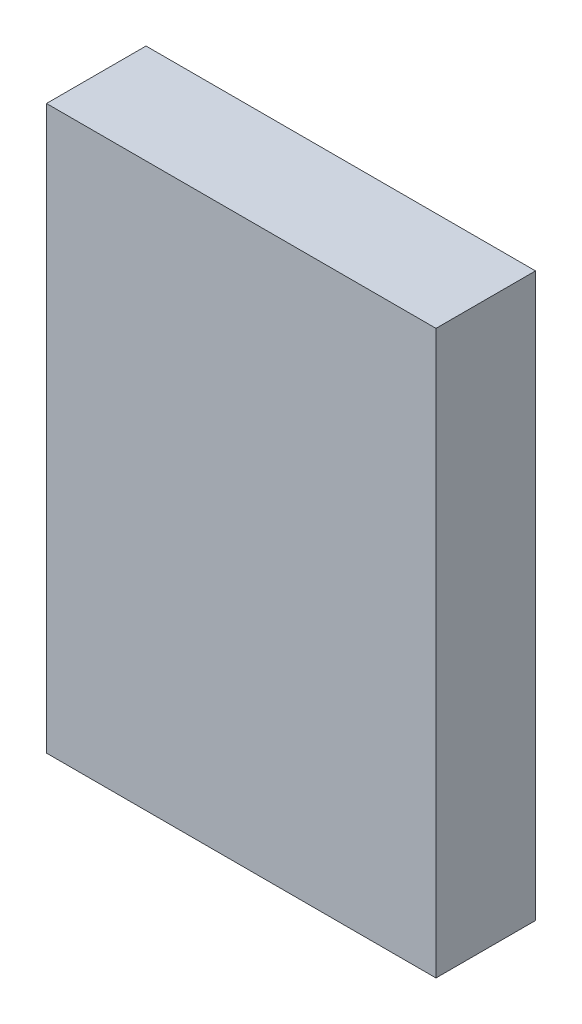
ISO-10303-21;
HEADER;
FILE_DESCRIPTION(('STEP AP214'),'2;1');
FILE_NAME('part.step','',(''),(''),'','','');
FILE_SCHEMA(('AUTOMOTIVE_DESIGN { 1 0 10303 214 1 1 1 1 }'));
ENDSEC;
DATA;
#1=APPLICATION_CONTEXT('core data for automotive mechanical design processes');
#2=APPLICATION_PROTOCOL_DEFINITION('international standard','automotive_design',2000,#1);
#3=PRODUCT_CONTEXT('',#1,'mechanical');
#4=PRODUCT('Part','Part','',(#3));
#5=PRODUCT_RELATED_PRODUCT_CATEGORY('part','',(#4));
#6=PRODUCT_DEFINITION_FORMATION('','',#4);
#7=PRODUCT_DEFINITION_CONTEXT('part definition',#1,'design');
#8=PRODUCT_DEFINITION('design','',#6,#7);
#9=PRODUCT_DEFINITION_SHAPE('','',#8);
#10=(LENGTH_UNIT() NAMED_UNIT(*) SI_UNIT(.MILLI.,.METRE.));
#11=(NAMED_UNIT(*) PLANE_ANGLE_UNIT() SI_UNIT($,.RADIAN.));
#12=(NAMED_UNIT(*) SI_UNIT($,.STERADIAN.) SOLID_ANGLE_UNIT());
#13=UNCERTAINTY_MEASURE_WITH_UNIT(LENGTH_MEASURE(1.E-05),#10,'distance_accuracy_value','');
#14=(GEOMETRIC_REPRESENTATION_CONTEXT(3) GLOBAL_UNCERTAINTY_ASSIGNED_CONTEXT((#13)) GLOBAL_UNIT_ASSIGNED_CONTEXT((#10,
#11,#12)) REPRESENTATION_CONTEXT('',''));
#15=CARTESIAN_POINT('',(0.,0.,0.));
#16=DIRECTION('',(0.,0.,1.));
#17=DIRECTION('',(1.,0.,0.));
#18=AXIS2_PLACEMENT_3D('',#15,#16,#17);
#19=CARTESIAN_POINT('',(-2.25000058,3.25000112,1.15000024));
#20=DIRECTION('',(0.,0.,1.));
#21=DIRECTION('',(1.,0.,0.));
#22=AXIS2_PLACEMENT_3D('',#19,#20,#21);
#23=PLANE('',#22);
#24=DIRECTION('',(0.,1.,0.));
#25=VECTOR('',#24,1.);
#26=CARTESIAN_POINT('',(2.25000058,3.25000112,1.15000024));
#27=LINE('',#26,#25);
#28=CARTESIAN_POINT('',(2.25000058,3.25000112,1.15000024));
#29=VERTEX_POINT('',#28);
#30=CARTESIAN_POINT('',(2.25000058,-3.25000112,1.15000024));
#31=VERTEX_POINT('',#30);
#32=EDGE_CURVE('E51',#29,#31,#27,.F.);
#33=ORIENTED_EDGE('',*,*,#32,.F.);
#34=DIRECTION('',(1.,0.,0.));
#35=VECTOR('',#34,1.);
#36=CARTESIAN_POINT('',(-2.25000058,3.25000112,1.15000024));
#37=LINE('',#36,#35);
#38=CARTESIAN_POINT('',(-2.25000058,3.25000112,1.15000024));
#39=VERTEX_POINT('',#38);
#40=EDGE_CURVE('E66',#39,#29,#37,.T.);
#41=ORIENTED_EDGE('',*,*,#40,.F.);
#42=DIRECTION('',(0.,1.,0.));
#43=VECTOR('',#42,1.);
#44=CARTESIAN_POINT('',(-2.25000058,-3.25000112,1.15000024));
#45=LINE('',#44,#43);
#46=CARTESIAN_POINT('',(-2.25000058,-3.25000112,1.15000024));
#47=VERTEX_POINT('',#46);
#48=EDGE_CURVE('E18',#47,#39,#45,.T.);
#49=ORIENTED_EDGE('',*,*,#48,.F.);
#50=DIRECTION('',(1.,0.,0.));
#51=VECTOR('',#50,1.);
#52=CARTESIAN_POINT('',(2.25000058,-3.25000112,1.15000024));
#53=LINE('',#52,#51);
#54=EDGE_CURVE('E56',#31,#47,#53,.F.);
#55=ORIENTED_EDGE('',*,*,#54,.F.);
#56=EDGE_LOOP('',(#33,#41,#49,#55));
#57=FACE_BOUND('',#56,.T.);
#58=ADVANCED_FACE('F15',(#57),#23,.T.);
#59=CARTESIAN_POINT('',(-2.25000058,-3.25000112,0.));
#60=DIRECTION('',(-1.,0.,0.));
#61=DIRECTION('',(0.,0.,1.));
#62=AXIS2_PLACEMENT_3D('',#59,#60,#61);
#63=PLANE('',#62);
#64=DIRECTION('',(0.,0.,1.));
#65=VECTOR('',#64,1.);
#66=CARTESIAN_POINT('',(-2.25000058,3.25000112,0.));
#67=LINE('',#66,#65);
#68=CARTESIAN_POINT('',(-2.25000058,3.25000112,0.));
#69=VERTEX_POINT('',#68);
#70=EDGE_CURVE('E77',#69,#39,#67,.T.);
#71=ORIENTED_EDGE('',*,*,#70,.F.);
#72=DIRECTION('',(0.,1.,0.));
#73=VECTOR('',#72,1.);
#74=CARTESIAN_POINT('',(-2.25000058,3.25000112,0.));
#75=LINE('',#74,#73);
#76=CARTESIAN_POINT('',(-2.25000058,-3.25000112,0.));
#77=VERTEX_POINT('',#76);
#78=EDGE_CURVE('E72',#69,#77,#75,.F.);
#79=ORIENTED_EDGE('',*,*,#78,.T.);
#80=DIRECTION('',(0.,0.,-1.));
#81=VECTOR('',#80,1.);
#82=CARTESIAN_POINT('',(-2.25000058,-3.25000112,0.));
#83=LINE('',#82,#81);
#84=EDGE_CURVE('E61',#47,#77,#83,.T.);
#85=ORIENTED_EDGE('',*,*,#84,.F.);
#86=ORIENTED_EDGE('',*,*,#48,.T.);
#87=EDGE_LOOP('',(#71,#79,#85,#86));
#88=FACE_BOUND('',#87,.T.);
#89=ADVANCED_FACE('F71',(#88),#63,.T.);
#90=CARTESIAN_POINT('',(2.25000058,-3.25000112,0.));
#91=DIRECTION('',(0.,-1.,0.));
#92=DIRECTION('',(0.,0.,-1.));
#93=AXIS2_PLACEMENT_3D('',#90,#91,#92);
#94=PLANE('',#93);
#95=ORIENTED_EDGE('',*,*,#84,.T.);
#96=DIRECTION('',(1.,0.,0.));
#97=VECTOR('',#96,1.);
#98=CARTESIAN_POINT('',(-2.25000058,-3.25000112,0.));
#99=LINE('',#98,#97);
#100=CARTESIAN_POINT('',(2.25000058,-3.25000112,0.));
#101=VERTEX_POINT('',#100);
#102=EDGE_CURVE('E82',#77,#101,#99,.T.);
#103=ORIENTED_EDGE('',*,*,#102,.T.);
#104=DIRECTION('',(0.,0.,-1.));
#105=VECTOR('',#104,1.);
#106=CARTESIAN_POINT('',(2.25000058,-3.25000112,0.));
#107=LINE('',#106,#105);
#108=EDGE_CURVE('E63',#31,#101,#107,.T.);
#109=ORIENTED_EDGE('',*,*,#108,.F.);
#110=ORIENTED_EDGE('',*,*,#54,.T.);
#111=EDGE_LOOP('',(#95,#103,#109,#110));
#112=FACE_BOUND('',#111,.T.);
#113=ADVANCED_FACE('F58',(#112),#94,.T.);
#114=CARTESIAN_POINT('',(2.25000058,3.25000112,0.));
#115=DIRECTION('',(1.,0.,0.));
#116=DIRECTION('',(0.,0.,-1.));
#117=AXIS2_PLACEMENT_3D('',#114,#115,#116);
#118=PLANE('',#117);
#119=ORIENTED_EDGE('',*,*,#108,.T.);
#120=DIRECTION('',(0.,1.,0.));
#121=VECTOR('',#120,1.);
#122=CARTESIAN_POINT('',(2.25000058,3.25000112,0.));
#123=LINE('',#122,#121);
#124=CARTESIAN_POINT('',(2.25000058,3.25000112,0.));
#125=VERTEX_POINT('',#124);
#126=EDGE_CURVE('E24',#101,#125,#123,.T.);
#127=ORIENTED_EDGE('',*,*,#126,.T.);
#128=DIRECTION('',(0.,0.,1.));
#129=VECTOR('',#128,1.);
#130=CARTESIAN_POINT('',(2.25000058,3.25000112,0.));
#131=LINE('',#130,#129);
#132=EDGE_CURVE('E32',#29,#125,#131,.F.);
#133=ORIENTED_EDGE('',*,*,#132,.F.);
#134=ORIENTED_EDGE('',*,*,#32,.T.);
#135=EDGE_LOOP('',(#119,#127,#133,#134));
#136=FACE_BOUND('',#135,.T.);
#137=ADVANCED_FACE('F86',(#136),#118,.T.);
#138=CARTESIAN_POINT('',(-2.25000058,3.25000112,0.));
#139=DIRECTION('',(0.,1.,0.));
#140=DIRECTION('',(0.,0.,1.));
#141=AXIS2_PLACEMENT_3D('',#138,#139,#140);
#142=PLANE('',#141);
#143=ORIENTED_EDGE('',*,*,#132,.T.);
#144=DIRECTION('',(1.,0.,0.));
#145=VECTOR('',#144,1.);
#146=CARTESIAN_POINT('',(-2.25000058,3.25000112,0.));
#147=LINE('',#146,#145);
#148=EDGE_CURVE('E10',#125,#69,#147,.F.);
#149=ORIENTED_EDGE('',*,*,#148,.T.);
#150=ORIENTED_EDGE('',*,*,#70,.T.);
#151=ORIENTED_EDGE('',*,*,#40,.T.);
#152=EDGE_LOOP('',(#143,#149,#150,#151));
#153=FACE_BOUND('',#152,.T.);
#154=ADVANCED_FACE('F89',(#153),#142,.T.);
#155=CARTESIAN_POINT('',(-2.25000058,3.25000112,0.));
#156=DIRECTION('',(0.,0.,1.));
#157=DIRECTION('',(1.,0.,0.));
#158=AXIS2_PLACEMENT_3D('',#155,#156,#157);
#159=PLANE('',#158);
#160=ORIENTED_EDGE('',*,*,#126,.F.);
#161=ORIENTED_EDGE('',*,*,#102,.F.);
#162=ORIENTED_EDGE('',*,*,#78,.F.);
#163=ORIENTED_EDGE('',*,*,#148,.F.);
#164=EDGE_LOOP('',(#160,#161,#162,#163));
#165=FACE_BOUND('',#164,.T.);
#166=ADVANCED_FACE('F88',(#165),#159,.F.);
#167=CLOSED_SHELL('',(#58,#89,#113,#137,#154,#166));
#168=MANIFOLD_SOLID_BREP('B1',#167);
#169=ADVANCED_BREP_SHAPE_REPRESENTATION('',(#18,#168),#14);
#170=SHAPE_DEFINITION_REPRESENTATION(#9,#169);
ENDSEC;
END-ISO-10303-21;
